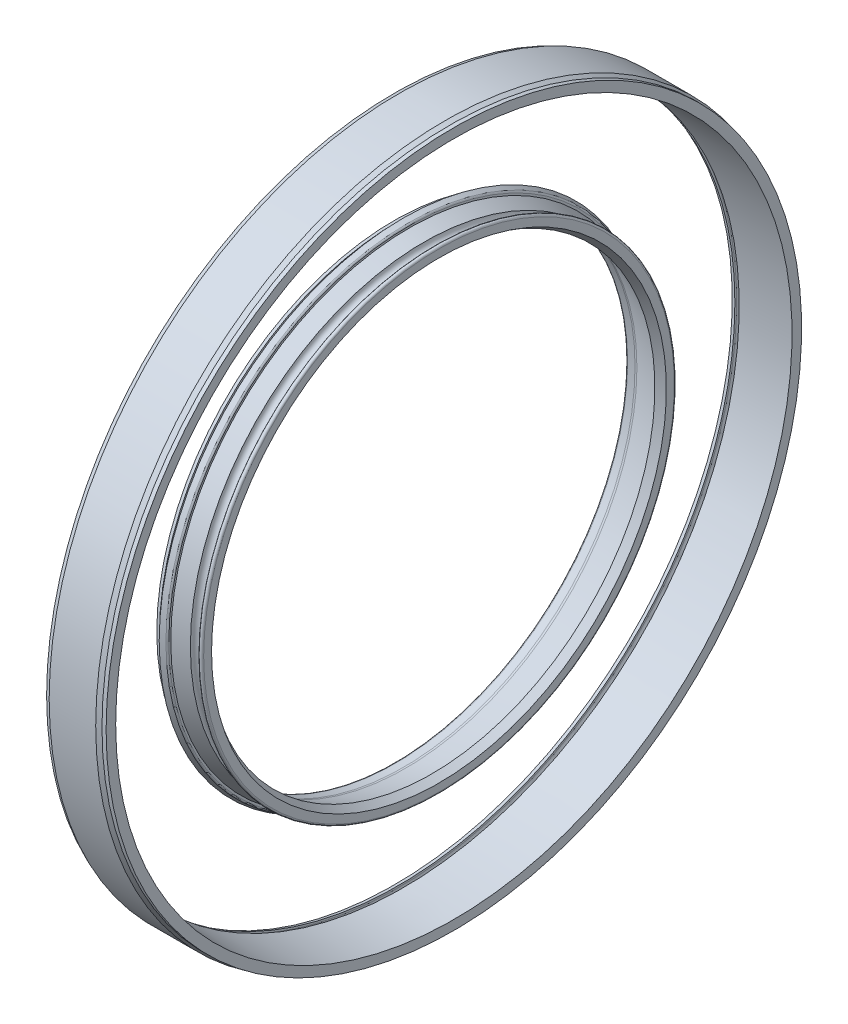
ISO-10303-21;
HEADER;
FILE_DESCRIPTION(('STEP AP214'),'2;1');
FILE_NAME('part.step','',(''),(''),'','','');
FILE_SCHEMA(('AUTOMOTIVE_DESIGN { 1 0 10303 214 1 1 1 1 }'));
ENDSEC;
DATA;
#1=APPLICATION_CONTEXT('core data for automotive mechanical design processes');
#2=APPLICATION_PROTOCOL_DEFINITION('international standard','automotive_design',2000,#1);
#3=PRODUCT_CONTEXT('',#1,'mechanical');
#4=PRODUCT('Part','Part','',(#3));
#5=PRODUCT_RELATED_PRODUCT_CATEGORY('part','',(#4));
#6=PRODUCT_DEFINITION_FORMATION('','',#4);
#7=PRODUCT_DEFINITION_CONTEXT('part definition',#1,'design');
#8=PRODUCT_DEFINITION('design','',#6,#7);
#9=PRODUCT_DEFINITION_SHAPE('','',#8);
#10=(LENGTH_UNIT() NAMED_UNIT(*) SI_UNIT(.MILLI.,.METRE.));
#11=(NAMED_UNIT(*) PLANE_ANGLE_UNIT() SI_UNIT($,.RADIAN.));
#12=(NAMED_UNIT(*) SI_UNIT($,.STERADIAN.) SOLID_ANGLE_UNIT());
#13=UNCERTAINTY_MEASURE_WITH_UNIT(LENGTH_MEASURE(1.E-05),#10,'distance_accuracy_value','');
#14=(GEOMETRIC_REPRESENTATION_CONTEXT(3) GLOBAL_UNCERTAINTY_ASSIGNED_CONTEXT((#13)) GLOBAL_UNIT_ASSIGNED_CONTEXT((#10,
#11,#12)) REPRESENTATION_CONTEXT('',''));
#15=CARTESIAN_POINT('',(0.,0.,0.));
#16=DIRECTION('',(0.,0.,1.));
#17=DIRECTION('',(1.,0.,0.));
#18=AXIS2_PLACEMENT_3D('',#15,#16,#17);
#19=CARTESIAN_POINT('',(-3.870625,0.,0.));
#20=DIRECTION('',(1.,0.,0.));
#21=DIRECTION('',(0.,0.,1.));
#22=AXIS2_PLACEMENT_3D('',#19,#20,#21);
#23=CONICAL_SURFACE('',#22,16.01025,0.301266639932819);
#24=CARTESIAN_POINT('',(-4.,0.,0.));
#25=DIRECTION('',(1.,0.,0.));
#26=DIRECTION('',(0.,0.,1.));
#27=AXIS2_PLACEMENT_3D('',#24,#25,#26);
#28=CIRCLE('',#27,15.97005);
#29=CARTESIAN_POINT('',(-4.,0.,15.97005));
#30=VERTEX_POINT('',#29);
#31=EDGE_CURVE('E10',#30,#30,#28,.T.);
#32=ORIENTED_EDGE('',*,*,#31,.T.);
#33=EDGE_LOOP('',(#32));
#34=FACE_BOUND('',#33,.T.);
#35=CARTESIAN_POINT('',(-3.74125,0.,0.));
#36=DIRECTION('',(1.,0.,0.));
#37=DIRECTION('',(0.,0.,1.));
#38=AXIS2_PLACEMENT_3D('',#35,#36,#37);
#39=CIRCLE('',#38,16.05045);
#40=CARTESIAN_POINT('',(-3.74125,0.,16.05045));
#41=VERTEX_POINT('',#40);
#42=EDGE_CURVE('E123',#41,#41,#39,.T.);
#43=ORIENTED_EDGE('',*,*,#42,.F.);
#44=EDGE_LOOP('',(#43));
#45=FACE_BOUND('',#44,.T.);
#46=ADVANCED_FACE('F15',(#34,#45),#23,.T.);
#47=CARTESIAN_POINT('',(-4.,0.,15.8225199));
#48=DIRECTION('',(-1.,0.,0.));
#49=DIRECTION('',(0.,0.,-1.));
#50=AXIS2_PLACEMENT_3D('',#47,#48,#49);
#51=PLANE('',#50);
#52=CARTESIAN_POINT('',(-4.,0.,0.));
#53=DIRECTION('',(1.,0.,0.));
#54=DIRECTION('',(0.,0.,1.));
#55=AXIS2_PLACEMENT_3D('',#52,#53,#54);
#56=CIRCLE('',#55,15.6749898);
#57=CARTESIAN_POINT('',(-4.,0.,15.6749898));
#58=VERTEX_POINT('',#57);
#59=EDGE_CURVE('E25',#58,#58,#56,.T.);
#60=ORIENTED_EDGE('',*,*,#59,.T.);
#61=EDGE_LOOP('',(#60));
#62=FACE_BOUND('',#61,.T.);
#63=ORIENTED_EDGE('',*,*,#31,.F.);
#64=EDGE_LOOP('',(#63));
#65=FACE_BOUND('',#64,.T.);
#66=ADVANCED_FACE('F203',(#62,#65),#51,.T.);
#67=CARTESIAN_POINT('',(-3.90001,0.,0.));
#68=DIRECTION('',(1.,0.,0.));
#69=DIRECTION('',(0.,1.,0.));
#70=AXIS2_PLACEMENT_3D('',#67,#68,#69);
#71=TOROIDAL_SURFACE('',#70,15.6749898,0.09999);
#72=CARTESIAN_POINT('',(-3.90001,0.,0.));
#73=DIRECTION('',(1.,0.,0.));
#74=DIRECTION('',(0.,0.,1.));
#75=AXIS2_PLACEMENT_3D('',#72,#73,#74);
#76=CIRCLE('',#75,15.5749998);
#77=CARTESIAN_POINT('',(-3.90001,0.,15.5749998));
#78=VERTEX_POINT('',#77);
#79=EDGE_CURVE('E161',#78,#78,#76,.T.);
#80=ORIENTED_EDGE('',*,*,#79,.T.);
#81=EDGE_LOOP('',(#80));
#82=FACE_BOUND('',#81,.T.);
#83=ORIENTED_EDGE('',*,*,#59,.F.);
#84=EDGE_LOOP('',(#83));
#85=FACE_BOUND('',#84,.T.);
#86=ADVANCED_FACE('F208',(#82,#85),#71,.T.);
#87=CARTESIAN_POINT('',(-3.64813,0.,0.));
#88=DIRECTION('',(-1.,0.,0.));
#89=DIRECTION('',(0.,0.,1.));
#90=AXIS2_PLACEMENT_3D('',#87,#88,#89);
#91=CYLINDRICAL_SURFACE('',#90,15.5749998);
#92=CARTESIAN_POINT('',(-3.39625,0.,0.));
#93=DIRECTION('',(1.,0.,0.));
#94=DIRECTION('',(0.,0.,1.));
#95=AXIS2_PLACEMENT_3D('',#92,#93,#94);
#96=CIRCLE('',#95,15.5749998);
#97=CARTESIAN_POINT('',(-3.39625,0.,15.5749998));
#98=VERTEX_POINT('',#97);
#99=EDGE_CURVE('E158',#98,#98,#96,.T.);
#100=ORIENTED_EDGE('',*,*,#99,.T.);
#101=EDGE_LOOP('',(#100));
#102=FACE_BOUND('',#101,.T.);
#103=ORIENTED_EDGE('',*,*,#79,.F.);
#104=EDGE_LOOP('',(#103));
#105=FACE_BOUND('',#104,.T.);
#106=ADVANCED_FACE('F455',(#102,#105),#91,.F.);
#107=CARTESIAN_POINT('',(-3.39625,0.,0.));
#108=DIRECTION('',(1.,0.,0.));
#109=DIRECTION('',(0.,1.,0.));
#110=AXIS2_PLACEMENT_3D('',#107,#108,#109);
#111=TOROIDAL_SURFACE('',#110,15.075,0.499999800000062);
#112=CARTESIAN_POINT('',(-3.24668727025722,0.,0.));
#113=DIRECTION('',(1.,0.,0.));
#114=DIRECTION('',(0.,0.,1.));
#115=AXIS2_PLACEMENT_3D('',#112,#113,#114);
#116=CIRCLE('',#115,15.5521066860483);
#117=CARTESIAN_POINT('',(-3.24668727025722,0.,15.5521066860483));
#118=VERTEX_POINT('',#117);
#119=EDGE_CURVE('E139',#118,#118,#116,.T.);
#120=ORIENTED_EDGE('',*,*,#119,.T.);
#121=EDGE_LOOP('',(#120));
#122=FACE_BOUND('',#121,.T.);
#123=ORIENTED_EDGE('',*,*,#99,.F.);
#124=EDGE_LOOP('',(#123));
#125=FACE_BOUND('',#124,.T.);
#126=ADVANCED_FACE('F445',(#122,#125),#111,.F.);
#127=CARTESIAN_POINT('',(-2.36607419312861,0.,0.));
#128=DIRECTION('',(-1.,0.,0.));
#129=DIRECTION('',(0.,0.,1.));
#130=AXIS2_PLACEMENT_3D('',#127,#128,#129);
#131=CONICAL_SURFACE('',#130,15.2760533930241,0.303776092138875);
#132=CARTESIAN_POINT('',(-1.485461116,0.,0.));
#133=DIRECTION('',(1.,0.,0.));
#134=DIRECTION('',(0.,0.,1.));
#135=AXIS2_PLACEMENT_3D('',#132,#133,#134);
#136=CIRCLE('',#135,15.0000001);
#137=CARTESIAN_POINT('',(-1.485461116,0.,15.0000001));
#138=VERTEX_POINT('',#137);
#139=EDGE_CURVE('E137',#138,#138,#136,.T.);
#140=ORIENTED_EDGE('',*,*,#139,.T.);
#141=EDGE_LOOP('',(#140));
#142=FACE_BOUND('',#141,.T.);
#143=ORIENTED_EDGE('',*,*,#119,.F.);
#144=EDGE_LOOP('',(#143));
#145=FACE_BOUND('',#144,.T.);
#146=ADVANCED_FACE('F436',(#142,#145),#131,.F.);
#147=CARTESIAN_POINT('',(-1.242731158,0.,0.));
#148=DIRECTION('',(1.,0.,0.));
#149=DIRECTION('',(0.,0.,1.));
#150=AXIS2_PLACEMENT_3D('',#147,#148,#149);
#151=CONICAL_SURFACE('',#150,15.1439996,0.535441336725622);
#152=CARTESIAN_POINT('',(-1.0000012,0.,0.));
#153=DIRECTION('',(1.,0.,0.));
#154=DIRECTION('',(0.,0.,1.));
#155=AXIS2_PLACEMENT_3D('',#152,#153,#154);
#156=CIRCLE('',#155,15.2879991);
#157=CARTESIAN_POINT('',(-1.0000012,0.,15.2879991));
#158=VERTEX_POINT('',#157);
#159=EDGE_CURVE('E135',#158,#158,#156,.T.);
#160=ORIENTED_EDGE('',*,*,#159,.T.);
#161=EDGE_LOOP('',(#160));
#162=FACE_BOUND('',#161,.T.);
#163=ORIENTED_EDGE('',*,*,#139,.F.);
#164=EDGE_LOOP('',(#163));
#165=FACE_BOUND('',#164,.T.);
#166=ADVANCED_FACE('F219',(#162,#165),#151,.F.);
#167=CARTESIAN_POINT('',(-1.0000012,0.,15.55324905));
#168=DIRECTION('',(1.,0.,0.));
#169=DIRECTION('',(0.,0.,1.));
#170=AXIS2_PLACEMENT_3D('',#167,#168,#169);
#171=PLANE('',#170);
#172=CARTESIAN_POINT('',(-1.0000012,0.,0.));
#173=DIRECTION('',(1.,0.,0.));
#174=DIRECTION('',(0.,0.,1.));
#175=AXIS2_PLACEMENT_3D('',#172,#173,#174);
#176=CIRCLE('',#175,15.818499);
#177=CARTESIAN_POINT('',(-1.0000012,0.,15.818499));
#178=VERTEX_POINT('',#177);
#179=EDGE_CURVE('E132',#178,#178,#176,.T.);
#180=ORIENTED_EDGE('',*,*,#179,.T.);
#181=EDGE_LOOP('',(#180));
#182=FACE_BOUND('',#181,.T.);
#183=ORIENTED_EDGE('',*,*,#159,.F.);
#184=EDGE_LOOP('',(#183));
#185=FACE_BOUND('',#184,.T.);
#186=ADVANCED_FACE('F215',(#182,#185),#171,.T.);
#187=CARTESIAN_POINT('',(-1.1315011,0.,0.));
#188=DIRECTION('',(1.,0.,0.));
#189=DIRECTION('',(0.,1.,0.));
#190=AXIS2_PLACEMENT_3D('',#187,#188,#189);
#191=TOROIDAL_SURFACE('',#190,15.818499,0.1314999);
#192=CARTESIAN_POINT('',(-1.263001,0.,0.));
#193=DIRECTION('',(1.,0.,0.));
#194=DIRECTION('',(0.,0.,1.));
#195=AXIS2_PLACEMENT_3D('',#192,#193,#194);
#196=CIRCLE('',#195,15.818499);
#197=CARTESIAN_POINT('',(-1.263001,0.,15.818499));
#198=VERTEX_POINT('',#197);
#199=EDGE_CURVE('E136',#198,#198,#196,.T.);
#200=ORIENTED_EDGE('',*,*,#199,.T.);
#201=EDGE_LOOP('',(#200));
#202=FACE_BOUND('',#201,.T.);
#203=ORIENTED_EDGE('',*,*,#179,.F.);
#204=EDGE_LOOP('',(#203));
#205=FACE_BOUND('',#204,.T.);
#206=ADVANCED_FACE('F218',(#202,#205),#191,.T.);
#207=CARTESIAN_POINT('',(-1.263001,0.,15.759249));
#208=DIRECTION('',(-1.,0.,0.));
#209=DIRECTION('',(0.,0.,-1.));
#210=AXIS2_PLACEMENT_3D('',#207,#208,#209);
#211=PLANE('',#210);
#212=CARTESIAN_POINT('',(-1.263001,0.,0.));
#213=DIRECTION('',(1.,0.,0.));
#214=DIRECTION('',(0.,0.,1.));
#215=AXIS2_PLACEMENT_3D('',#212,#213,#214);
#216=CIRCLE('',#215,15.699999);
#217=CARTESIAN_POINT('',(-1.263001,0.,15.699999));
#218=VERTEX_POINT('',#217);
#219=EDGE_CURVE('E167',#218,#218,#216,.T.);
#220=ORIENTED_EDGE('',*,*,#219,.T.);
#221=EDGE_LOOP('',(#220));
#222=FACE_BOUND('',#221,.T.);
#223=ORIENTED_EDGE('',*,*,#199,.F.);
#224=EDGE_LOOP('',(#223));
#225=FACE_BOUND('',#224,.T.);
#226=ADVANCED_FACE('F403',(#222,#225),#211,.T.);
#227=CARTESIAN_POINT('',(-1.638001,0.,0.));
#228=DIRECTION('',(1.,0.,0.));
#229=DIRECTION('',(0.,1.,0.));
#230=AXIS2_PLACEMENT_3D('',#227,#228,#229);
#231=TOROIDAL_SURFACE('',#230,15.699999,0.375);
#232=CARTESIAN_POINT('',(-2.013001,0.,0.));
#233=DIRECTION('',(1.,0.,0.));
#234=DIRECTION('',(0.,0.,1.));
#235=AXIS2_PLACEMENT_3D('',#232,#233,#234);
#236=CIRCLE('',#235,15.699999);
#237=CARTESIAN_POINT('',(-2.013001,0.,15.699999));
#238=VERTEX_POINT('',#237);
#239=EDGE_CURVE('E146',#238,#238,#236,.T.);
#240=ORIENTED_EDGE('',*,*,#239,.T.);
#241=EDGE_LOOP('',(#240));
#242=FACE_BOUND('',#241,.T.);
#243=ORIENTED_EDGE('',*,*,#219,.F.);
#244=EDGE_LOOP('',(#243));
#245=FACE_BOUND('',#244,.T.);
#246=ADVANCED_FACE('F213',(#242,#245),#231,.F.);
#247=CARTESIAN_POINT('',(-2.50462901085,0.,0.));
#248=DIRECTION('',(-1.,0.,0.));
#249=DIRECTION('',(0.,0.,1.));
#250=AXIS2_PLACEMENT_3D('',#247,#248,#249);
#251=CONICAL_SURFACE('',#250,15.86677712925,0.327053896021307);
#252=CARTESIAN_POINT('',(-2.9962570217,0.,0.));
#253=DIRECTION('',(1.,0.,0.));
#254=DIRECTION('',(0.,0.,1.));
#255=AXIS2_PLACEMENT_3D('',#252,#253,#254);
#256=CIRCLE('',#255,16.0335552585);
#257=CARTESIAN_POINT('',(-2.9962570217,0.,16.0335552585));
#258=VERTEX_POINT('',#257);
#259=EDGE_CURVE('E144',#258,#258,#256,.T.);
#260=ORIENTED_EDGE('',*,*,#259,.T.);
#261=EDGE_LOOP('',(#260));
#262=FACE_BOUND('',#261,.T.);
#263=ORIENTED_EDGE('',*,*,#239,.F.);
#264=EDGE_LOOP('',(#263));
#265=FACE_BOUND('',#264,.T.);
#266=ADVANCED_FACE('F385',(#262,#265),#251,.T.);
#267=CARTESIAN_POINT('',(-2.9962570217,0.,16.0992802485));
#268=DIRECTION('',(1.,0.,0.));
#269=DIRECTION('',(0.,0.,1.));
#270=AXIS2_PLACEMENT_3D('',#267,#268,#269);
#271=PLANE('',#270);
#272=CARTESIAN_POINT('',(-2.9962570217,0.,0.));
#273=DIRECTION('',(1.,0.,0.));
#274=DIRECTION('',(0.,0.,1.));
#275=AXIS2_PLACEMENT_3D('',#272,#273,#274);
#276=CIRCLE('',#275,16.1650052385);
#277=CARTESIAN_POINT('',(-2.9962570217,0.,16.1650052385));
#278=VERTEX_POINT('',#277);
#279=EDGE_CURVE('E147',#278,#278,#276,.T.);
#280=ORIENTED_EDGE('',*,*,#279,.T.);
#281=EDGE_LOOP('',(#280));
#282=FACE_BOUND('',#281,.T.);
#283=ORIENTED_EDGE('',*,*,#259,.F.);
#284=EDGE_LOOP('',(#283));
#285=FACE_BOUND('',#284,.T.);
#286=ADVANCED_FACE('F375',(#282,#285),#271,.T.);
#287=CARTESIAN_POINT('',(-3.1212568217,0.,0.));
#288=DIRECTION('',(1.,0.,0.));
#289=DIRECTION('',(0.,1.,0.));
#290=AXIS2_PLACEMENT_3D('',#287,#288,#289);
#291=TOROIDAL_SURFACE('',#290,16.1650052385,0.124999800000001);
#292=CARTESIAN_POINT('',(-3.07430001996914,0.,0.));
#293=DIRECTION('',(1.,0.,0.));
#294=DIRECTION('',(0.,0.,1.));
#295=AXIS2_PLACEMENT_3D('',#292,#293,#294);
#296=CIRCLE('',#295,16.2808500000184);
#297=CARTESIAN_POINT('',(-3.07430001996914,0.,16.2808500000184));
#298=VERTEX_POINT('',#297);
#299=EDGE_CURVE('E154',#298,#298,#296,.T.);
#300=ORIENTED_EDGE('',*,*,#299,.T.);
#301=EDGE_LOOP('',(#300));
#302=FACE_BOUND('',#301,.T.);
#303=ORIENTED_EDGE('',*,*,#279,.F.);
#304=EDGE_LOOP('',(#303));
#305=FACE_BOUND('',#304,.T.);
#306=ADVANCED_FACE('F366',(#302,#305),#291,.T.);
#307=CARTESIAN_POINT('',(-3.23527500998457,0.,0.));
#308=DIRECTION('',(-1.,0.,0.));
#309=DIRECTION('',(0.,0.,1.));
#310=AXIS2_PLACEMENT_3D('',#307,#308,#309);
#311=CONICAL_SURFACE('',#310,16.3461000000092,0.385103453003653);
#312=CARTESIAN_POINT('',(-3.39625,0.,0.));
#313=DIRECTION('',(1.,0.,0.));
#314=DIRECTION('',(0.,0.,1.));
#315=AXIS2_PLACEMENT_3D('',#312,#313,#314);
#316=CIRCLE('',#315,16.41135);
#317=CARTESIAN_POINT('',(-3.39625,0.,16.41135));
#318=VERTEX_POINT('',#317);
#319=EDGE_CURVE('E151',#318,#318,#316,.T.);
#320=ORIENTED_EDGE('',*,*,#319,.T.);
#321=EDGE_LOOP('',(#320));
#322=FACE_BOUND('',#321,.T.);
#323=ORIENTED_EDGE('',*,*,#299,.F.);
#324=EDGE_LOOP('',(#323));
#325=FACE_BOUND('',#324,.T.);
#326=ADVANCED_FACE('F178',(#322,#325),#311,.T.);
#327=CARTESIAN_POINT('',(-3.56875,0.,0.));
#328=DIRECTION('',(-1.,0.,0.));
#329=DIRECTION('',(0.,0.,1.));
#330=AXIS2_PLACEMENT_3D('',#327,#328,#329);
#331=CYLINDRICAL_SURFACE('',#330,15.825);
#332=CARTESIAN_POINT('',(-3.39625,0.,0.));
#333=DIRECTION('',(1.,0.,0.));
#334=DIRECTION('',(0.,0.,1.));
#335=AXIS2_PLACEMENT_3D('',#332,#333,#334);
#336=CIRCLE('',#335,15.825);
#337=CARTESIAN_POINT('',(-3.39625,0.,15.825));
#338=VERTEX_POINT('',#337);
#339=EDGE_CURVE('E157',#338,#338,#336,.T.);
#340=ORIENTED_EDGE('',*,*,#339,.F.);
#341=EDGE_LOOP('',(#340));
#342=FACE_BOUND('',#341,.T.);
#343=CARTESIAN_POINT('',(-3.74125,0.,0.));
#344=DIRECTION('',(1.,0.,0.));
#345=DIRECTION('',(0.,0.,1.));
#346=AXIS2_PLACEMENT_3D('',#343,#344,#345);
#347=CIRCLE('',#346,15.825);
#348=CARTESIAN_POINT('',(-3.74125,0.,15.825));
#349=VERTEX_POINT('',#348);
#350=EDGE_CURVE('E143',#349,#349,#347,.T.);
#351=ORIENTED_EDGE('',*,*,#350,.T.);
#352=EDGE_LOOP('',(#351));
#353=FACE_BOUND('',#352,.T.);
#354=ADVANCED_FACE('F186',(#342,#353),#331,.T.);
#355=CARTESIAN_POINT('',(-3.39625,0.,19.2905006));
#356=DIRECTION('',(1.,0.,0.));
#357=DIRECTION('',(0.,0.,1.));
#358=AXIS2_PLACEMENT_3D('',#355,#356,#357);
#359=PLANE('',#358);
#360=ORIENTED_EDGE('',*,*,#339,.T.);
#361=EDGE_LOOP('',(#360));
#362=FACE_BOUND('',#361,.T.);
#363=ORIENTED_EDGE('',*,*,#319,.F.);
#364=EDGE_LOOP('',(#363));
#365=FACE_BOUND('',#364,.T.);
#366=ADVANCED_FACE('F183',(#362,#365),#359,.F.);
#367=CARTESIAN_POINT('',(-3.74125,0.,19.2905006));
#368=DIRECTION('',(-1.,0.,0.));
#369=DIRECTION('',(0.,0.,-1.));
#370=AXIS2_PLACEMENT_3D('',#367,#368,#369);
#371=PLANE('',#370);
#372=ORIENTED_EDGE('',*,*,#350,.F.);
#373=EDGE_LOOP('',(#372));
#374=FACE_BOUND('',#373,.T.);
#375=ORIENTED_EDGE('',*,*,#42,.T.);
#376=EDGE_LOOP('',(#375));
#377=FACE_BOUND('',#376,.T.);
#378=ADVANCED_FACE('F185',(#374,#377),#371,.F.);
#379=CLOSED_SHELL('',(#46,#66,#86,#106,#126,#146,#166,#186,#206,#226,#246,#266,#286,#306,#326,
#354,#366,#378));
#380=MANIFOLD_SOLID_BREP('B1',#379);
#381=CARTESIAN_POINT('',(-3.74125,0.,19.2905006));
#382=DIRECTION('',(-1.,0.,0.));
#383=DIRECTION('',(0.,0.,-1.));
#384=AXIS2_PLACEMENT_3D('',#381,#382,#383);
#385=PLANE('',#384);
#386=CARTESIAN_POINT('',(-3.74125,0.,0.));
#387=DIRECTION('',(1.,0.,0.));
#388=DIRECTION('',(0.,0.,1.));
#389=AXIS2_PLACEMENT_3D('',#386,#387,#388);
#390=CIRCLE('',#389,22.7560012);
#391=CARTESIAN_POINT('',(-3.74125,0.,22.7560012));
#392=VERTEX_POINT('',#391);
#393=EDGE_CURVE('E122',#392,#392,#390,.T.);
#394=ORIENTED_EDGE('',*,*,#393,.T.);
#395=EDGE_LOOP('',(#394));
#396=FACE_BOUND('',#395,.T.);
#397=CARTESIAN_POINT('',(-3.74125,0.,0.));
#398=DIRECTION('',(1.,0.,0.));
#399=DIRECTION('',(0.,0.,1.));
#400=AXIS2_PLACEMENT_3D('',#397,#398,#399);
#401=CIRCLE('',#400,22.63235212);
#402=CARTESIAN_POINT('',(-3.74125,0.,-22.63235212));
#403=VERTEX_POINT('',#402);
#404=EDGE_CURVE('E115',#403,#403,#401,.T.);
#405=ORIENTED_EDGE('',*,*,#404,.F.);
#406=EDGE_LOOP('',(#405));
#407=FACE_BOUND('',#406,.T.);
#408=ADVANCED_FACE('F201',(#396,#407),#385,.F.);
#409=CARTESIAN_POINT('',(-3.296251,0.,0.));
#410=DIRECTION('',(1.,0.,0.));
#411=DIRECTION('',(0.,1.,0.));
#412=AXIS2_PLACEMENT_3D('',#409,#410,#411);
#413=TOROIDAL_SURFACE('',#412,22.7560012,0.444999);
#414=ORIENTED_EDGE('',*,*,#393,.F.);
#415=EDGE_LOOP('',(#414));
#416=FACE_BOUND('',#415,.T.);
#417=CARTESIAN_POINT('',(-3.296251,0.,0.));
#418=DIRECTION('',(1.,0.,0.));
#419=DIRECTION('',(0.,0.,1.));
#420=AXIS2_PLACEMENT_3D('',#417,#418,#419);
#421=CIRCLE('',#420,23.2010002);
#422=CARTESIAN_POINT('',(-3.296251,0.,23.2010002));
#423=VERTEX_POINT('',#422);
#424=EDGE_CURVE('E120',#423,#423,#421,.T.);
#425=ORIENTED_EDGE('',*,*,#424,.T.);
#426=EDGE_LOOP('',(#425));
#427=FACE_BOUND('',#426,.T.);
#428=ADVANCED_FACE('F236',(#416,#427),#413,.F.);
#429=CARTESIAN_POINT('',(-1.9052675,0.,0.));
#430=DIRECTION('',(-1.,0.,0.));
#431=DIRECTION('',(0.,0.,1.));
#432=AXIS2_PLACEMENT_3D('',#429,#430,#431);
#433=CYLINDRICAL_SURFACE('',#432,23.2010002);
#434=ORIENTED_EDGE('',*,*,#424,.F.);
#435=EDGE_LOOP('',(#434));
#436=FACE_BOUND('',#435,.T.);
#437=CARTESIAN_POINT('',(-0.514284,0.,0.));
#438=DIRECTION('',(1.,0.,0.));
#439=DIRECTION('',(0.,0.,1.));
#440=AXIS2_PLACEMENT_3D('',#437,#438,#439);
#441=CIRCLE('',#440,23.2010002);
#442=CARTESIAN_POINT('',(-0.514284,0.,23.2010002));
#443=VERTEX_POINT('',#442);
#444=EDGE_CURVE('E118',#443,#443,#441,.T.);
#445=ORIENTED_EDGE('',*,*,#444,.T.);
#446=EDGE_LOOP('',(#445));
#447=FACE_BOUND('',#446,.T.);
#448=ADVANCED_FACE('F232',(#436,#447),#433,.F.);
#449=CARTESIAN_POINT('',(-0.514284,0.,23.0285002));
#450=DIRECTION('',(1.,0.,0.));
#451=DIRECTION('',(0.,0.,1.));
#452=AXIS2_PLACEMENT_3D('',#449,#450,#451);
#453=PLANE('',#452);
#454=ORIENTED_EDGE('',*,*,#444,.F.);
#455=EDGE_LOOP('',(#454));
#456=FACE_BOUND('',#455,.T.);
#457=CARTESIAN_POINT('',(-0.514284,0.,0.));
#458=DIRECTION('',(1.,0.,0.));
#459=DIRECTION('',(0.,0.,1.));
#460=AXIS2_PLACEMENT_3D('',#457,#458,#459);
#461=CIRCLE('',#460,22.8560002);
#462=CARTESIAN_POINT('',(-0.514284,0.,22.8560002));
#463=VERTEX_POINT('',#462);
#464=EDGE_CURVE('E109',#463,#463,#461,.T.);
#465=ORIENTED_EDGE('',*,*,#464,.T.);
#466=EDGE_LOOP('',(#465));
#467=FACE_BOUND('',#466,.T.);
#468=ADVANCED_FACE('F235',(#456,#467),#453,.F.);
#469=CARTESIAN_POINT('',(-1.9052675,0.,0.));
#470=DIRECTION('',(-1.,0.,0.));
#471=DIRECTION('',(0.,0.,1.));
#472=AXIS2_PLACEMENT_3D('',#469,#470,#471);
#473=CYLINDRICAL_SURFACE('',#472,22.8560002);
#474=ORIENTED_EDGE('',*,*,#464,.F.);
#475=EDGE_LOOP('',(#474));
#476=FACE_BOUND('',#475,.T.);
#477=CARTESIAN_POINT('',(-3.296251,0.,0.));
#478=DIRECTION('',(1.,0.,0.));
#479=DIRECTION('',(0.,0.,1.));
#480=AXIS2_PLACEMENT_3D('',#477,#478,#479);
#481=CIRCLE('',#480,22.8560002);
#482=CARTESIAN_POINT('',(-3.296251,0.,22.8560002));
#483=VERTEX_POINT('',#482);
#484=EDGE_CURVE('E107',#483,#483,#481,.T.);
#485=ORIENTED_EDGE('',*,*,#484,.T.);
#486=EDGE_LOOP('',(#485));
#487=FACE_BOUND('',#486,.T.);
#488=ADVANCED_FACE('F258',(#476,#487),#473,.T.);
#489=CARTESIAN_POINT('',(-3.296251,0.,0.));
#490=DIRECTION('',(1.,0.,0.));
#491=DIRECTION('',(0.,1.,0.));
#492=AXIS2_PLACEMENT_3D('',#489,#490,#491);
#493=TOROIDAL_SURFACE('',#492,22.7560012,0.0999990000000022);
#494=ORIENTED_EDGE('',*,*,#484,.F.);
#495=EDGE_LOOP('',(#494));
#496=FACE_BOUND('',#495,.T.);
#497=CARTESIAN_POINT('',(-3.39625,0.,0.));
#498=DIRECTION('',(1.,0.,0.));
#499=DIRECTION('',(0.,0.,1.));
#500=AXIS2_PLACEMENT_3D('',#497,#498,#499);
#501=CIRCLE('',#500,22.7560012);
#502=CARTESIAN_POINT('',(-3.39625,0.,22.7560012));
#503=VERTEX_POINT('',#502);
#504=EDGE_CURVE('E110',#503,#503,#501,.T.);
#505=ORIENTED_EDGE('',*,*,#504,.T.);
#506=EDGE_LOOP('',(#505));
#507=FACE_BOUND('',#506,.T.);
#508=ADVANCED_FACE('F255',(#496,#507),#493,.T.);
#509=CARTESIAN_POINT('',(-3.39625,0.,19.2905006));
#510=DIRECTION('',(1.,0.,0.));
#511=DIRECTION('',(0.,0.,1.));
#512=AXIS2_PLACEMENT_3D('',#509,#510,#511);
#513=PLANE('',#512);
#514=ORIENTED_EDGE('',*,*,#504,.F.);
#515=EDGE_LOOP('',(#514));
#516=FACE_BOUND('',#515,.T.);
#517=CARTESIAN_POINT('',(-3.39625,0.,0.));
#518=DIRECTION('',(1.,0.,0.));
#519=DIRECTION('',(0.,0.,1.));
#520=AXIS2_PLACEMENT_3D('',#517,#518,#519);
#521=CIRCLE('',#520,22.5787522);
#522=CARTESIAN_POINT('',(-3.39625,0.,22.5787522));
#523=VERTEX_POINT('',#522);
#524=EDGE_CURVE('E111',#523,#523,#521,.T.);
#525=ORIENTED_EDGE('',*,*,#524,.T.);
#526=EDGE_LOOP('',(#525));
#527=FACE_BOUND('',#526,.T.);
#528=ADVANCED_FACE('F17',(#516,#527),#513,.F.);
#529=CARTESIAN_POINT('',(-1.698125,0.,0.));
#530=DIRECTION('',(1.,0.,0.));
#531=DIRECTION('',(0.,0.,1.));
#532=AXIS2_PLACEMENT_3D('',#529,#530,#531);
#533=CONICAL_SURFACE('',#532,22.65537715,0.0450926803674557);
#534=CARTESIAN_POINT('',(0.,0.,0.));
#535=DIRECTION('',(1.,0.,0.));
#536=DIRECTION('',(0.,0.,1.));
#537=AXIS2_PLACEMENT_3D('',#534,#535,#536);
#538=CIRCLE('',#537,22.7320021);
#539=CARTESIAN_POINT('',(0.,0.,22.7320021));
#540=VERTEX_POINT('',#539);
#541=EDGE_CURVE('E103',#540,#540,#538,.T.);
#542=ORIENTED_EDGE('',*,*,#541,.T.);
#543=EDGE_LOOP('',(#542));
#544=FACE_BOUND('',#543,.T.);
#545=ORIENTED_EDGE('',*,*,#524,.F.);
#546=EDGE_LOOP('',(#545));
#547=FACE_BOUND('',#546,.T.);
#548=ADVANCED_FACE('F244',(#544,#547),#533,.F.);
#549=CARTESIAN_POINT('',(-3.784375,0.,0.));
#550=DIRECTION('',(-1.,0.,0.));
#551=DIRECTION('',(0.,0.,1.));
#552=AXIS2_PLACEMENT_3D('',#549,#550,#551);
#553=CONICAL_SURFACE('',#552,22.6457521,0.301266216998826);
#554=CARTESIAN_POINT('',(-4.,0.,0.));
#555=DIRECTION('',(1.,0.,0.));
#556=DIRECTION('',(0.,0.,1.));
#557=AXIS2_PLACEMENT_3D('',#554,#555,#556);
#558=CIRCLE('',#557,22.712752);
#559=CARTESIAN_POINT('',(-4.,0.,22.712752));
#560=VERTEX_POINT('',#559);
#561=EDGE_CURVE('E113',#560,#560,#558,.T.);
#562=ORIENTED_EDGE('',*,*,#561,.F.);
#563=EDGE_LOOP('',(#562));
#564=FACE_BOUND('',#563,.T.);
#565=ORIENTED_EDGE('',*,*,#404,.T.);
#566=EDGE_LOOP('',(#565));
#567=FACE_BOUND('',#566,.T.);
#568=ADVANCED_FACE('F241',(#564,#567),#553,.F.);
#569=CARTESIAN_POINT('',(-4.,0.,23.043877));
#570=DIRECTION('',(-1.,0.,0.));
#571=DIRECTION('',(0.,0.,-1.));
#572=AXIS2_PLACEMENT_3D('',#569,#570,#571);
#573=PLANE('',#572);
#574=ORIENTED_EDGE('',*,*,#561,.T.);
#575=EDGE_LOOP('',(#574));
#576=FACE_BOUND('',#575,.T.);
#577=CARTESIAN_POINT('',(-4.,0.,0.));
#578=DIRECTION('',(1.,0.,0.));
#579=DIRECTION('',(0.,0.,1.));
#580=AXIS2_PLACEMENT_3D('',#577,#578,#579);
#581=CIRCLE('',#580,23.375002);
#582=CARTESIAN_POINT('',(-4.,0.,23.375002));
#583=VERTEX_POINT('',#582);
#584=EDGE_CURVE('E116',#583,#583,#581,.T.);
#585=ORIENTED_EDGE('',*,*,#584,.F.);
#586=EDGE_LOOP('',(#585));
#587=FACE_BOUND('',#586,.T.);
#588=ADVANCED_FACE('F225',(#576,#587),#573,.T.);
#589=CARTESIAN_POINT('',(-3.85154286,0.,0.));
#590=DIRECTION('',(1.,0.,0.));
#591=DIRECTION('',(0.,0.,1.));
#592=AXIS2_PLACEMENT_3D('',#589,#590,#591);
#593=CONICAL_SURFACE('',#592,23.437501,0.398469408299396);
#594=ORIENTED_EDGE('',*,*,#584,.T.);
#595=EDGE_LOOP('',(#594));
#596=FACE_BOUND('',#595,.T.);
#597=CARTESIAN_POINT('',(-3.70308572,0.,0.));
#598=DIRECTION('',(1.,0.,0.));
#599=DIRECTION('',(0.,0.,1.));
#600=AXIS2_PLACEMENT_3D('',#597,#598,#599);
#601=CIRCLE('',#600,23.5);
#602=CARTESIAN_POINT('',(-3.70308572,0.,23.5));
#603=VERTEX_POINT('',#602);
#604=EDGE_CURVE('E19',#603,#603,#601,.T.);
#605=ORIENTED_EDGE('',*,*,#604,.F.);
#606=EDGE_LOOP('',(#605));
#607=FACE_BOUND('',#606,.T.);
#608=ADVANCED_FACE('F221',(#596,#607),#593,.T.);
#609=CARTESIAN_POINT('',(-2.139,0.,0.));
#610=DIRECTION('',(-1.,0.,0.));
#611=DIRECTION('',(0.,0.,1.));
#612=AXIS2_PLACEMENT_3D('',#609,#610,#611);
#613=CYLINDRICAL_SURFACE('',#612,23.5);
#614=ORIENTED_EDGE('',*,*,#604,.T.);
#615=EDGE_LOOP('',(#614));
#616=FACE_BOUND('',#615,.T.);
#617=CARTESIAN_POINT('',(-0.57491428,0.,0.));
#618=DIRECTION('',(1.,0.,0.));
#619=DIRECTION('',(0.,0.,1.));
#620=AXIS2_PLACEMENT_3D('',#617,#618,#619);
#621=CIRCLE('',#620,23.5);
#622=CARTESIAN_POINT('',(-0.57491428,0.,23.5));
#623=VERTEX_POINT('',#622);
#624=EDGE_CURVE('E99',#623,#623,#621,.T.);
#625=ORIENTED_EDGE('',*,*,#624,.F.);
#626=EDGE_LOOP('',(#625));
#627=FACE_BOUND('',#626,.T.);
#628=ADVANCED_FACE('F224',(#616,#627),#613,.T.);
#629=CARTESIAN_POINT('',(-0.42645714,0.,0.));
#630=DIRECTION('',(-1.,0.,0.));
#631=DIRECTION('',(0.,0.,1.));
#632=AXIS2_PLACEMENT_3D('',#629,#630,#631);
#633=CONICAL_SURFACE('',#632,23.437501,0.398469408299397);
#634=ORIENTED_EDGE('',*,*,#624,.T.);
#635=EDGE_LOOP('',(#634));
#636=FACE_BOUND('',#635,.T.);
#637=CARTESIAN_POINT('',(-0.278,0.,0.));
#638=DIRECTION('',(1.,0.,0.));
#639=DIRECTION('',(0.,0.,1.));
#640=AXIS2_PLACEMENT_3D('',#637,#638,#639);
#641=CIRCLE('',#640,23.375002);
#642=CARTESIAN_POINT('',(-0.278,0.,23.375002));
#643=VERTEX_POINT('',#642);
#644=EDGE_CURVE('E95',#643,#643,#641,.T.);
#645=ORIENTED_EDGE('',*,*,#644,.F.);
#646=EDGE_LOOP('',(#645));
#647=FACE_BOUND('',#646,.T.);
#648=ADVANCED_FACE('F231',(#636,#647),#633,.T.);
#649=CARTESIAN_POINT('',(-0.139,0.,0.));
#650=DIRECTION('',(-1.,0.,0.));
#651=DIRECTION('',(0.,0.,1.));
#652=AXIS2_PLACEMENT_3D('',#649,#650,#651);
#653=CYLINDRICAL_SURFACE('',#652,23.375002);
#654=ORIENTED_EDGE('',*,*,#644,.T.);
#655=EDGE_LOOP('',(#654));
#656=FACE_BOUND('',#655,.T.);
#657=CARTESIAN_POINT('',(0.,0.,0.));
#658=DIRECTION('',(1.,0.,0.));
#659=DIRECTION('',(0.,0.,1.));
#660=AXIS2_PLACEMENT_3D('',#657,#658,#659);
#661=CIRCLE('',#660,23.375002);
#662=CARTESIAN_POINT('',(0.,0.,23.375002));
#663=VERTEX_POINT('',#662);
#664=EDGE_CURVE('E100',#663,#663,#661,.T.);
#665=ORIENTED_EDGE('',*,*,#664,.F.);
#666=EDGE_LOOP('',(#665));
#667=FACE_BOUND('',#666,.T.);
#668=ADVANCED_FACE('F96',(#656,#667),#653,.T.);
#669=CARTESIAN_POINT('',(0.,0.,23.05350205));
#670=DIRECTION('',(1.,0.,0.));
#671=DIRECTION('',(0.,0.,1.));
#672=AXIS2_PLACEMENT_3D('',#669,#670,#671);
#673=PLANE('',#672);
#674=ORIENTED_EDGE('',*,*,#664,.T.);
#675=EDGE_LOOP('',(#674));
#676=FACE_BOUND('',#675,.T.);
#677=ORIENTED_EDGE('',*,*,#541,.F.);
#678=EDGE_LOOP('',(#677));
#679=FACE_BOUND('',#678,.T.);
#680=ADVANCED_FACE('F230',(#676,#679),#673,.T.);
#681=CLOSED_SHELL('',(#408,#428,#448,#468,#488,#508,#528,#548,#568,#588,#608,#628,#648,#668,#680));
#682=MANIFOLD_SOLID_BREP('B1',#681);
#683=ADVANCED_BREP_SHAPE_REPRESENTATION('',(#18,#380,#682),#14);
#684=SHAPE_DEFINITION_REPRESENTATION(#9,#683);
ENDSEC;
END-ISO-10303-21;
